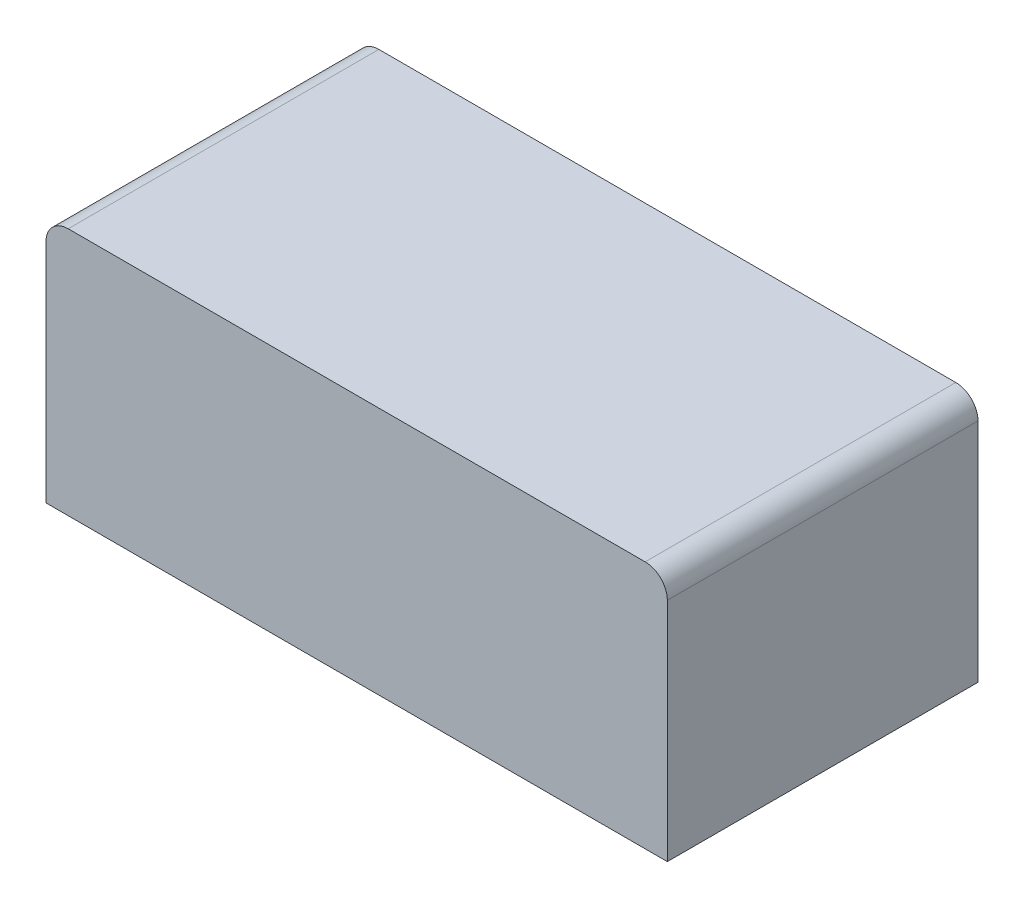
ISO-10303-21;
HEADER;
FILE_DESCRIPTION(('STEP AP214'),'2;1');
FILE_NAME('part.step','',(''),(''),'','','');
FILE_SCHEMA(('AUTOMOTIVE_DESIGN { 1 0 10303 214 1 1 1 1 }'));
ENDSEC;
DATA;
#1=APPLICATION_CONTEXT('core data for automotive mechanical design processes');
#2=APPLICATION_PROTOCOL_DEFINITION('international standard','automotive_design',2000,#1);
#3=PRODUCT_CONTEXT('',#1,'mechanical');
#4=PRODUCT('Part','Part','',(#3));
#5=PRODUCT_RELATED_PRODUCT_CATEGORY('part','',(#4));
#6=PRODUCT_DEFINITION_FORMATION('','',#4);
#7=PRODUCT_DEFINITION_CONTEXT('part definition',#1,'design');
#8=PRODUCT_DEFINITION('design','',#6,#7);
#9=PRODUCT_DEFINITION_SHAPE('','',#8);
#10=(LENGTH_UNIT() NAMED_UNIT(*) SI_UNIT(.MILLI.,.METRE.));
#11=(NAMED_UNIT(*) PLANE_ANGLE_UNIT() SI_UNIT($,.RADIAN.));
#12=(NAMED_UNIT(*) SI_UNIT($,.STERADIAN.) SOLID_ANGLE_UNIT());
#13=UNCERTAINTY_MEASURE_WITH_UNIT(LENGTH_MEASURE(1.E-05),#10,'distance_accuracy_value','');
#14=(GEOMETRIC_REPRESENTATION_CONTEXT(3) GLOBAL_UNCERTAINTY_ASSIGNED_CONTEXT((#13)) GLOBAL_UNIT_ASSIGNED_CONTEXT((#10,
#11,#12)) REPRESENTATION_CONTEXT('',''));
#15=CARTESIAN_POINT('',(0.,0.,0.));
#16=DIRECTION('',(0.,0.,1.));
#17=DIRECTION('',(1.,0.,0.));
#18=AXIS2_PLACEMENT_3D('',#15,#16,#17);
#19=CARTESIAN_POINT('',(1.39999999999999,1.12,0.699999999999992));
#20=DIRECTION('',(0.,0.,-1.));
#21=DIRECTION('',(-1.,0.,0.));
#22=AXIS2_PLACEMENT_3D('',#19,#20,#21);
#23=PLANE('',#22);
#24=DIRECTION('',(0.,-1.,0.));
#25=VECTOR('',#24,1.);
#26=CARTESIAN_POINT('',(1.39999999999999,1.12,0.699999999999992));
#27=LINE('',#26,#25);
#28=CARTESIAN_POINT('',(1.39999999999999,1.02,0.699999999999992));
#29=VERTEX_POINT('',#28);
#30=CARTESIAN_POINT('',(1.39999999999999,0.,0.699999999999992));
#31=VERTEX_POINT('',#30);
#32=EDGE_CURVE('E83',#29,#31,#27,.T.);
#33=ORIENTED_EDGE('',*,*,#32,.F.);
#34=CARTESIAN_POINT('',(1.29999999999999,1.02,0.699999999999993));
#35=DIRECTION('',(0.,0.,-1.));
#36=DIRECTION('',(-1.,0.,0.));
#37=AXIS2_PLACEMENT_3D('',#34,#35,#36);
#38=CIRCLE('',#37,0.1);
#39=CARTESIAN_POINT('',(1.29999999999999,1.12,0.699999999999993));
#40=VERTEX_POINT('',#39);
#41=EDGE_CURVE('E40',#29,#40,#38,.F.);
#42=ORIENTED_EDGE('',*,*,#41,.T.);
#43=DIRECTION('',(1.,0.,0.));
#44=VECTOR('',#43,1.);
#45=CARTESIAN_POINT('',(1.39999999999999,1.12,0.699999999999992));
#46=LINE('',#45,#44);
#47=CARTESIAN_POINT('',(-1.30000000000001,1.12,0.699999999999999));
#48=VERTEX_POINT('',#47);
#49=EDGE_CURVE('E111',#48,#40,#46,.T.);
#50=ORIENTED_EDGE('',*,*,#49,.F.);
#51=CARTESIAN_POINT('',(-1.30000000000001,1.02,0.699999999999999));
#52=DIRECTION('',(0.,0.,-1.));
#53=DIRECTION('',(-1.,0.,0.));
#54=AXIS2_PLACEMENT_3D('',#51,#52,#53);
#55=CIRCLE('',#54,0.1);
#56=CARTESIAN_POINT('',(-1.40000000000001,1.02,0.699999999999999));
#57=VERTEX_POINT('',#56);
#58=EDGE_CURVE('E47',#48,#57,#55,.F.);
#59=ORIENTED_EDGE('',*,*,#58,.T.);
#60=DIRECTION('',(0.,-1.,0.));
#61=VECTOR('',#60,1.);
#62=CARTESIAN_POINT('',(-1.40000000000001,1.12,0.699999999999999));
#63=LINE('',#62,#61);
#64=CARTESIAN_POINT('',(-1.40000000000001,0.,0.699999999999999));
#65=VERTEX_POINT('',#64);
#66=EDGE_CURVE('E101',#57,#65,#63,.T.);
#67=ORIENTED_EDGE('',*,*,#66,.T.);
#68=DIRECTION('',(1.,0.,0.));
#69=VECTOR('',#68,1.);
#70=CARTESIAN_POINT('',(1.39999999999999,0.,0.699999999999992));
#71=LINE('',#70,#69);
#72=EDGE_CURVE('E97',#65,#31,#71,.T.);
#73=ORIENTED_EDGE('',*,*,#72,.T.);
#74=EDGE_LOOP('',(#33,#42,#50,#59,#67,#73));
#75=FACE_BOUND('',#74,.T.);
#76=ADVANCED_FACE('F32',(#75),#23,.F.);
#77=CARTESIAN_POINT('',(1.39999999999999,1.12,0.699999999999992));
#78=DIRECTION('',(-1.,0.,0.));
#79=DIRECTION('',(0.,0.,1.));
#80=AXIS2_PLACEMENT_3D('',#77,#78,#79);
#81=PLANE('',#80);
#82=DIRECTION('',(0.,-1.,0.));
#83=VECTOR('',#82,1.);
#84=CARTESIAN_POINT('',(1.39999999999999,1.12,-0.699999999999992));
#85=LINE('',#84,#83);
#86=CARTESIAN_POINT('',(1.39999999999999,1.02,-0.699999999999992));
#87=VERTEX_POINT('',#86);
#88=CARTESIAN_POINT('',(1.39999999999999,0.,-0.699999999999992));
#89=VERTEX_POINT('',#88);
#90=EDGE_CURVE('E91',#87,#89,#85,.T.);
#91=ORIENTED_EDGE('',*,*,#90,.F.);
#92=DIRECTION('',(0.,0.,-1.));
#93=VECTOR('',#92,1.);
#94=CARTESIAN_POINT('',(1.39999999999999,1.02,0.699999999999992));
#95=LINE('',#94,#93);
#96=EDGE_CURVE('E55',#87,#29,#95,.F.);
#97=ORIENTED_EDGE('',*,*,#96,.T.);
#98=ORIENTED_EDGE('',*,*,#32,.T.);
#99=DIRECTION('',(0.,0.,-1.));
#100=VECTOR('',#99,1.);
#101=CARTESIAN_POINT('',(1.39999999999999,0.,0.699999999999992));
#102=LINE('',#101,#100);
#103=EDGE_CURVE('E86',#31,#89,#102,.T.);
#104=ORIENTED_EDGE('',*,*,#103,.T.);
#105=EDGE_LOOP('',(#91,#97,#98,#104));
#106=FACE_BOUND('',#105,.T.);
#107=ADVANCED_FACE('F85',(#106),#81,.F.);
#108=CARTESIAN_POINT('',(1.39999999999999,1.12,-0.699999999999992));
#109=DIRECTION('',(0.,0.,1.));
#110=DIRECTION('',(1.,0.,0.));
#111=AXIS2_PLACEMENT_3D('',#108,#109,#110);
#112=PLANE('',#111);
#113=DIRECTION('',(-1.,0.,0.));
#114=VECTOR('',#113,1.);
#115=CARTESIAN_POINT('',(1.39999999999999,1.12,-0.699999999999992));
#116=LINE('',#115,#114);
#117=CARTESIAN_POINT('',(1.29999999999999,1.12,-0.699999999999993));
#118=VERTEX_POINT('',#117);
#119=CARTESIAN_POINT('',(-1.30000000000001,1.12,-0.699999999999999));
#120=VERTEX_POINT('',#119);
#121=EDGE_CURVE('E105',#118,#120,#116,.T.);
#122=ORIENTED_EDGE('',*,*,#121,.F.);
#123=CARTESIAN_POINT('',(1.29999999999999,1.02,-0.699999999999993));
#124=DIRECTION('',(0.,0.,1.));
#125=DIRECTION('',(1.,0.,0.));
#126=AXIS2_PLACEMENT_3D('',#123,#124,#125);
#127=CIRCLE('',#126,0.1);
#128=EDGE_CURVE('E123',#118,#87,#127,.F.);
#129=ORIENTED_EDGE('',*,*,#128,.T.);
#130=ORIENTED_EDGE('',*,*,#90,.T.);
#131=DIRECTION('',(-1.,0.,0.));
#132=VECTOR('',#131,1.);
#133=CARTESIAN_POINT('',(1.39999999999999,0.,-0.699999999999992));
#134=LINE('',#133,#132);
#135=CARTESIAN_POINT('',(-1.40000000000001,0.,-0.699999999999999));
#136=VERTEX_POINT('',#135);
#137=EDGE_CURVE('E99',#89,#136,#134,.T.);
#138=ORIENTED_EDGE('',*,*,#137,.T.);
#139=DIRECTION('',(0.,-1.,0.));
#140=VECTOR('',#139,1.);
#141=CARTESIAN_POINT('',(-1.40000000000001,1.12,-0.699999999999999));
#142=LINE('',#141,#140);
#143=CARTESIAN_POINT('',(-1.40000000000001,1.02,-0.699999999999999));
#144=VERTEX_POINT('',#143);
#145=EDGE_CURVE('E113',#144,#136,#142,.T.);
#146=ORIENTED_EDGE('',*,*,#145,.F.);
#147=CARTESIAN_POINT('',(-1.30000000000001,1.02,-0.699999999999999));
#148=DIRECTION('',(0.,0.,1.));
#149=DIRECTION('',(1.,0.,0.));
#150=AXIS2_PLACEMENT_3D('',#147,#148,#149);
#151=CIRCLE('',#150,0.1);
#152=EDGE_CURVE('E121',#144,#120,#151,.F.);
#153=ORIENTED_EDGE('',*,*,#152,.T.);
#154=EDGE_LOOP('',(#122,#129,#130,#138,#146,#153));
#155=FACE_BOUND('',#154,.T.);
#156=ADVANCED_FACE('F136',(#155),#112,.F.);
#157=CARTESIAN_POINT('',(-1.40000000000001,1.12,0.699999999999999));
#158=DIRECTION('',(1.,0.,0.));
#159=DIRECTION('',(0.,0.,-1.));
#160=AXIS2_PLACEMENT_3D('',#157,#158,#159);
#161=PLANE('',#160);
#162=ORIENTED_EDGE('',*,*,#66,.F.);
#163=DIRECTION('',(0.,0.,1.));
#164=VECTOR('',#163,1.);
#165=CARTESIAN_POINT('',(-1.40000000000001,1.02,0.699999999999999));
#166=LINE('',#165,#164);
#167=EDGE_CURVE('E11',#57,#144,#166,.F.);
#168=ORIENTED_EDGE('',*,*,#167,.T.);
#169=ORIENTED_EDGE('',*,*,#145,.T.);
#170=DIRECTION('',(0.,0.,1.));
#171=VECTOR('',#170,1.);
#172=CARTESIAN_POINT('',(-1.40000000000001,0.,0.699999999999999));
#173=LINE('',#172,#171);
#174=EDGE_CURVE('E109',#136,#65,#173,.T.);
#175=ORIENTED_EDGE('',*,*,#174,.T.);
#176=EDGE_LOOP('',(#162,#168,#169,#175));
#177=FACE_BOUND('',#176,.T.);
#178=ADVANCED_FACE('F142',(#177),#161,.F.);
#179=CARTESIAN_POINT('',(-1.40000000000001,1.12,0.699999999999999));
#180=DIRECTION('',(0.,-1.,0.));
#181=DIRECTION('',(0.,0.,-1.));
#182=AXIS2_PLACEMENT_3D('',#179,#180,#181);
#183=PLANE('',#182);
#184=ORIENTED_EDGE('',*,*,#49,.T.);
#185=DIRECTION('',(0.,0.,-1.));
#186=VECTOR('',#185,1.);
#187=CARTESIAN_POINT('',(1.29999999999999,1.12,0.7));
#188=LINE('',#187,#186);
#189=EDGE_CURVE('E118',#40,#118,#188,.T.);
#190=ORIENTED_EDGE('',*,*,#189,.T.);
#191=ORIENTED_EDGE('',*,*,#121,.T.);
#192=DIRECTION('',(0.,0.,1.));
#193=VECTOR('',#192,1.);
#194=CARTESIAN_POINT('',(-1.30000000000001,1.12,0.699999999999999));
#195=LINE('',#194,#193);
#196=EDGE_CURVE('E90',#120,#48,#195,.T.);
#197=ORIENTED_EDGE('',*,*,#196,.T.);
#198=EDGE_LOOP('',(#184,#190,#191,#197));
#199=FACE_BOUND('',#198,.T.);
#200=ADVANCED_FACE('F130',(#199),#183,.F.);
#201=CARTESIAN_POINT('',(-1.40000000000001,0.,0.699999999999999));
#202=DIRECTION('',(0.,-1.,0.));
#203=DIRECTION('',(0.,0.,-1.));
#204=AXIS2_PLACEMENT_3D('',#201,#202,#203);
#205=PLANE('',#204);
#206=ORIENTED_EDGE('',*,*,#72,.F.);
#207=ORIENTED_EDGE('',*,*,#174,.F.);
#208=ORIENTED_EDGE('',*,*,#137,.F.);
#209=ORIENTED_EDGE('',*,*,#103,.F.);
#210=EDGE_LOOP('',(#206,#207,#208,#209));
#211=FACE_BOUND('',#210,.T.);
#212=ADVANCED_FACE('F95',(#211),#205,.T.);
#213=CARTESIAN_POINT('',(1.29999999999999,1.02,0.7));
#214=DIRECTION('',(0.,0.,-1.));
#215=DIRECTION('',(-1.,0.,0.));
#216=AXIS2_PLACEMENT_3D('',#213,#214,#215);
#217=CYLINDRICAL_SURFACE('',#216,0.1);
#218=ORIENTED_EDGE('',*,*,#41,.F.);
#219=ORIENTED_EDGE('',*,*,#96,.F.);
#220=ORIENTED_EDGE('',*,*,#128,.F.);
#221=ORIENTED_EDGE('',*,*,#189,.F.);
#222=EDGE_LOOP('',(#218,#219,#220,#221));
#223=FACE_BOUND('',#222,.T.);
#224=ADVANCED_FACE('F134',(#223),#217,.T.);
#225=CARTESIAN_POINT('',(-1.30000000000001,1.02,0.699999999999999));
#226=DIRECTION('',(0.,0.,1.));
#227=DIRECTION('',(1.,0.,0.));
#228=AXIS2_PLACEMENT_3D('',#225,#226,#227);
#229=CYLINDRICAL_SURFACE('',#228,0.1);
#230=ORIENTED_EDGE('',*,*,#152,.F.);
#231=ORIENTED_EDGE('',*,*,#167,.F.);
#232=ORIENTED_EDGE('',*,*,#58,.F.);
#233=ORIENTED_EDGE('',*,*,#196,.F.);
#234=EDGE_LOOP('',(#230,#231,#232,#233));
#235=FACE_BOUND('',#234,.T.);
#236=ADVANCED_FACE('F34',(#235),#229,.T.);
#237=CLOSED_SHELL('',(#76,#107,#156,#178,#200,#212,#224,#236));
#238=MANIFOLD_SOLID_BREP('B2',#237);
#239=ADVANCED_BREP_SHAPE_REPRESENTATION('',(#18,#238),#14);
#240=SHAPE_DEFINITION_REPRESENTATION(#9,#239);
ENDSEC;
END-ISO-10303-21;
